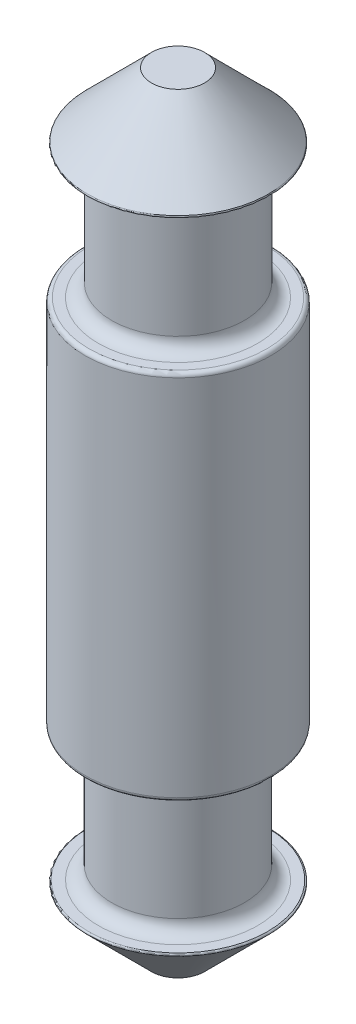
ISO-10303-21;
HEADER;
FILE_DESCRIPTION(('STEP AP214'),'2;1');
FILE_NAME('part.step','',(''),(''),'','','');
FILE_SCHEMA(('AUTOMOTIVE_DESIGN { 1 0 10303 214 1 1 1 1 }'));
ENDSEC;
DATA;
#1=APPLICATION_CONTEXT('core data for automotive mechanical design processes');
#2=APPLICATION_PROTOCOL_DEFINITION('international standard','automotive_design',2000,#1);
#3=PRODUCT_CONTEXT('',#1,'mechanical');
#4=PRODUCT('Part','Part','',(#3));
#5=PRODUCT_RELATED_PRODUCT_CATEGORY('part','',(#4));
#6=PRODUCT_DEFINITION_FORMATION('','',#4);
#7=PRODUCT_DEFINITION_CONTEXT('part definition',#1,'design');
#8=PRODUCT_DEFINITION('design','',#6,#7);
#9=PRODUCT_DEFINITION_SHAPE('','',#8);
#10=(LENGTH_UNIT() NAMED_UNIT(*) SI_UNIT(.MILLI.,.METRE.));
#11=(NAMED_UNIT(*) PLANE_ANGLE_UNIT() SI_UNIT($,.RADIAN.));
#12=(NAMED_UNIT(*) SI_UNIT($,.STERADIAN.) SOLID_ANGLE_UNIT());
#13=UNCERTAINTY_MEASURE_WITH_UNIT(LENGTH_MEASURE(1.E-05),#10,'distance_accuracy_value','');
#14=(GEOMETRIC_REPRESENTATION_CONTEXT(3) GLOBAL_UNCERTAINTY_ASSIGNED_CONTEXT((#13)) GLOBAL_UNIT_ASSIGNED_CONTEXT((#10,
#11,#12)) REPRESENTATION_CONTEXT('',''));
#15=CARTESIAN_POINT('',(0.,0.,0.));
#16=DIRECTION('',(0.,0.,1.));
#17=DIRECTION('',(1.,0.,0.));
#18=AXIS2_PLACEMENT_3D('',#15,#16,#17);
#19=CARTESIAN_POINT('',(0.,24.1,0.));
#20=DIRECTION('',(0.,1.,0.));
#21=DIRECTION('',(0.,0.,1.));
#22=AXIS2_PLACEMENT_3D('',#19,#20,#21);
#23=TOROIDAL_SURFACE('',#22,6.75857864376269,0.1);
#24=CARTESIAN_POINT('',(0.,24.,0.));
#25=DIRECTION('',(0.,1.,0.));
#26=DIRECTION('',(0.,0.,1.));
#27=AXIS2_PLACEMENT_3D('',#24,#25,#26);
#28=CIRCLE('',#27,6.75857864376269);
#29=CARTESIAN_POINT('',(0.,24.,6.75857864376269));
#30=VERTEX_POINT('',#29);
#31=EDGE_CURVE('E103',#30,#30,#28,.F.);
#32=ORIENTED_EDGE('',*,*,#31,.F.);
#33=EDGE_LOOP('',(#32));
#34=FACE_BOUND('',#33,.T.);
#35=CARTESIAN_POINT('',(0.,24.1707106781187,0.));
#36=DIRECTION('',(0.,1.,0.));
#37=DIRECTION('',(0.,0.,1.));
#38=AXIS2_PLACEMENT_3D('',#35,#36,#37);
#39=CIRCLE('',#38,6.82928932188135);
#40=CARTESIAN_POINT('',(0.,24.1707106781187,6.82928932188135));
#41=VERTEX_POINT('',#40);
#42=EDGE_CURVE('E99',#41,#41,#39,.T.);
#43=ORIENTED_EDGE('',*,*,#42,.F.);
#44=EDGE_LOOP('',(#43));
#45=FACE_BOUND('',#44,.T.);
#46=ADVANCED_FACE('F43',(#34,#45),#23,.T.);
#47=CARTESIAN_POINT('',(0.,14.,0.));
#48=DIRECTION('',(0.,-1.,0.));
#49=DIRECTION('',(0.,0.,-1.));
#50=AXIS2_PLACEMENT_3D('',#47,#48,#49);
#51=CYLINDRICAL_SURFACE('',#50,7.);
#52=CARTESIAN_POINT('',(0.,-13.7,0.));
#53=DIRECTION('',(0.,-1.,0.));
#54=DIRECTION('',(0.,0.,-1.));
#55=AXIS2_PLACEMENT_3D('',#52,#53,#54);
#56=CIRCLE('',#55,7.);
#57=CARTESIAN_POINT('',(0.,-13.7,-7.));
#58=VERTEX_POINT('',#57);
#59=EDGE_CURVE('E91',#58,#58,#56,.F.);
#60=ORIENTED_EDGE('',*,*,#59,.T.);
#61=EDGE_LOOP('',(#60));
#62=FACE_BOUND('',#61,.T.);
#63=CARTESIAN_POINT('',(0.,13.7,0.));
#64=DIRECTION('',(0.,1.,0.));
#65=DIRECTION('',(0.,0.,1.));
#66=AXIS2_PLACEMENT_3D('',#63,#64,#65);
#67=CIRCLE('',#66,7.);
#68=CARTESIAN_POINT('',(0.,13.7,7.));
#69=VERTEX_POINT('',#68);
#70=EDGE_CURVE('E95',#69,#69,#67,.F.);
#71=ORIENTED_EDGE('',*,*,#70,.T.);
#72=EDGE_LOOP('',(#71));
#73=FACE_BOUND('',#72,.T.);
#74=ADVANCED_FACE('F141',(#62,#73),#51,.T.);
#75=CARTESIAN_POINT('',(0.,14.,0.));
#76=DIRECTION('',(0.,1.,0.));
#77=DIRECTION('',(0.,0.,1.));
#78=AXIS2_PLACEMENT_3D('',#75,#76,#77);
#79=PLANE('',#78);
#80=CARTESIAN_POINT('',(0.,14.,0.));
#81=DIRECTION('',(0.,1.,0.));
#82=DIRECTION('',(0.,0.,1.));
#83=AXIS2_PLACEMENT_3D('',#80,#81,#82);
#84=CIRCLE('',#83,6.);
#85=CARTESIAN_POINT('',(0.,14.,6.));
#86=VERTEX_POINT('',#85);
#87=EDGE_CURVE('E56',#86,#86,#84,.F.);
#88=ORIENTED_EDGE('',*,*,#87,.T.);
#89=EDGE_LOOP('',(#88));
#90=FACE_BOUND('',#89,.T.);
#91=CARTESIAN_POINT('',(0.,14.,0.));
#92=DIRECTION('',(0.,1.,0.));
#93=DIRECTION('',(0.,0.,1.));
#94=AXIS2_PLACEMENT_3D('',#91,#92,#93);
#95=CIRCLE('',#94,6.7);
#96=CARTESIAN_POINT('',(0.,14.,6.7));
#97=VERTEX_POINT('',#96);
#98=EDGE_CURVE('E83',#97,#97,#95,.T.);
#99=ORIENTED_EDGE('',*,*,#98,.T.);
#100=EDGE_LOOP('',(#99));
#101=FACE_BOUND('',#100,.T.);
#102=ADVANCED_FACE('F147',(#90,#101),#79,.T.);
#103=CARTESIAN_POINT('',(0.,24.,0.));
#104=DIRECTION('',(0.,-1.,0.));
#105=DIRECTION('',(0.,0.,-1.));
#106=AXIS2_PLACEMENT_3D('',#103,#104,#105);
#107=CYLINDRICAL_SURFACE('',#106,5.);
#108=CARTESIAN_POINT('',(0.,15.,0.));
#109=DIRECTION('',(0.,1.,0.));
#110=DIRECTION('',(0.,0.,1.));
#111=AXIS2_PLACEMENT_3D('',#108,#109,#110);
#112=CIRCLE('',#111,5.);
#113=CARTESIAN_POINT('',(0.,15.,5.));
#114=VERTEX_POINT('',#113);
#115=EDGE_CURVE('E61',#114,#114,#112,.T.);
#116=ORIENTED_EDGE('',*,*,#115,.T.);
#117=EDGE_LOOP('',(#116));
#118=FACE_BOUND('',#117,.T.);
#119=CARTESIAN_POINT('',(0.,23.,0.));
#120=DIRECTION('',(0.,1.,0.));
#121=DIRECTION('',(0.,0.,1.));
#122=AXIS2_PLACEMENT_3D('',#119,#120,#121);
#123=CIRCLE('',#122,5.);
#124=CARTESIAN_POINT('',(0.,23.,5.));
#125=VERTEX_POINT('',#124);
#126=EDGE_CURVE('E67',#125,#125,#123,.F.);
#127=ORIENTED_EDGE('',*,*,#126,.T.);
#128=EDGE_LOOP('',(#127));
#129=FACE_BOUND('',#128,.T.);
#130=ADVANCED_FACE('F179',(#118,#129),#107,.T.);
#131=CARTESIAN_POINT('',(0.,24.,0.));
#132=DIRECTION('',(0.,-1.,0.));
#133=DIRECTION('',(0.,0.,1.));
#134=AXIS2_PLACEMENT_3D('',#131,#132,#133);
#135=CONICAL_SURFACE('',#134,7.,0.78539816339745);
#136=ORIENTED_EDGE('',*,*,#42,.T.);
#137=EDGE_LOOP('',(#136));
#138=FACE_BOUND('',#137,.T.);
#139=CARTESIAN_POINT('',(0.,29.,0.));
#140=DIRECTION('',(0.,1.,0.));
#141=DIRECTION('',(0.,0.,1.));
#142=AXIS2_PLACEMENT_3D('',#139,#140,#141);
#143=CIRCLE('',#142,1.99999999999998);
#144=CARTESIAN_POINT('',(0.,29.,1.99999999999998));
#145=VERTEX_POINT('',#144);
#146=EDGE_CURVE('E107',#145,#145,#143,.T.);
#147=ORIENTED_EDGE('',*,*,#146,.F.);
#148=EDGE_LOOP('',(#147));
#149=FACE_BOUND('',#148,.T.);
#150=ADVANCED_FACE('F182',(#138,#149),#135,.T.);
#151=CARTESIAN_POINT('',(0.,29.,0.));
#152=DIRECTION('',(0.,1.,0.));
#153=DIRECTION('',(0.,0.,1.));
#154=AXIS2_PLACEMENT_3D('',#151,#152,#153);
#155=PLANE('',#154);
#156=ORIENTED_EDGE('',*,*,#146,.T.);
#157=EDGE_LOOP('',(#156));
#158=FACE_BOUND('',#157,.T.);
#159=ADVANCED_FACE('F192',(#158),#155,.T.);
#160=CARTESIAN_POINT('',(0.,24.,0.));
#161=DIRECTION('',(0.,1.,0.));
#162=DIRECTION('',(0.,0.,1.));
#163=AXIS2_PLACEMENT_3D('',#160,#161,#162);
#164=PLANE('',#163);
#165=CARTESIAN_POINT('',(0.,24.,0.));
#166=DIRECTION('',(0.,1.,0.));
#167=DIRECTION('',(0.,0.,1.));
#168=AXIS2_PLACEMENT_3D('',#165,#166,#167);
#169=CIRCLE('',#168,6.);
#170=CARTESIAN_POINT('',(0.,24.,6.));
#171=VERTEX_POINT('',#170);
#172=EDGE_CURVE('E71',#171,#171,#169,.T.);
#173=ORIENTED_EDGE('',*,*,#172,.T.);
#174=EDGE_LOOP('',(#173));
#175=FACE_BOUND('',#174,.T.);
#176=ORIENTED_EDGE('',*,*,#31,.T.);
#177=EDGE_LOOP('',(#176));
#178=FACE_BOUND('',#177,.T.);
#179=ADVANCED_FACE('F188',(#175,#178),#164,.F.);
#180=CARTESIAN_POINT('',(0.,-24.1,0.));
#181=DIRECTION('',(0.,-1.,0.));
#182=DIRECTION('',(0.,0.,1.));
#183=AXIS2_PLACEMENT_3D('',#180,#181,#182);
#184=TOROIDAL_SURFACE('',#183,6.75857864376269,0.1);
#185=CARTESIAN_POINT('',(0.,-24.,0.));
#186=DIRECTION('',(0.,1.,0.));
#187=DIRECTION('',(0.,0.,1.));
#188=AXIS2_PLACEMENT_3D('',#185,#186,#187);
#189=CIRCLE('',#188,6.75857864376269);
#190=CARTESIAN_POINT('',(0.,-24.,6.75857864376269));
#191=VERTEX_POINT('',#190);
#192=EDGE_CURVE('E115',#191,#191,#189,.F.);
#193=ORIENTED_EDGE('',*,*,#192,.T.);
#194=EDGE_LOOP('',(#193));
#195=FACE_BOUND('',#194,.T.);
#196=CARTESIAN_POINT('',(0.,-24.1707106781187,0.));
#197=DIRECTION('',(0.,1.,0.));
#198=DIRECTION('',(0.,0.,1.));
#199=AXIS2_PLACEMENT_3D('',#196,#197,#198);
#200=CIRCLE('',#199,6.82928932188135);
#201=CARTESIAN_POINT('',(0.,-24.1707106781187,6.82928932188135));
#202=VERTEX_POINT('',#201);
#203=EDGE_CURVE('E111',#202,#202,#200,.T.);
#204=ORIENTED_EDGE('',*,*,#203,.T.);
#205=EDGE_LOOP('',(#204));
#206=FACE_BOUND('',#205,.T.);
#207=ADVANCED_FACE('F191',(#195,#206),#184,.T.);
#208=CARTESIAN_POINT('',(0.,-14.,0.));
#209=DIRECTION('',(0.,-1.,0.));
#210=DIRECTION('',(0.,0.,1.));
#211=AXIS2_PLACEMENT_3D('',#208,#209,#210);
#212=PLANE('',#211);
#213=CARTESIAN_POINT('',(0.,-14.,0.));
#214=DIRECTION('',(0.,-1.,0.));
#215=DIRECTION('',(0.,0.,-1.));
#216=AXIS2_PLACEMENT_3D('',#213,#214,#215);
#217=CIRCLE('',#216,6.);
#218=CARTESIAN_POINT('',(0.,-14.,-6.));
#219=VERTEX_POINT('',#218);
#220=EDGE_CURVE('E51',#219,#219,#217,.F.);
#221=ORIENTED_EDGE('',*,*,#220,.T.);
#222=EDGE_LOOP('',(#221));
#223=FACE_BOUND('',#222,.T.);
#224=CARTESIAN_POINT('',(0.,-14.,0.));
#225=DIRECTION('',(0.,-1.,0.));
#226=DIRECTION('',(0.,0.,-1.));
#227=AXIS2_PLACEMENT_3D('',#224,#225,#226);
#228=CIRCLE('',#227,6.7);
#229=CARTESIAN_POINT('',(0.,-14.,-6.7));
#230=VERTEX_POINT('',#229);
#231=EDGE_CURVE('E87',#230,#230,#228,.T.);
#232=ORIENTED_EDGE('',*,*,#231,.T.);
#233=EDGE_LOOP('',(#232));
#234=FACE_BOUND('',#233,.T.);
#235=ADVANCED_FACE('F198',(#223,#234),#212,.T.);
#236=CARTESIAN_POINT('',(0.,-24.,0.));
#237=DIRECTION('',(0.,1.,0.));
#238=DIRECTION('',(0.,0.,-1.));
#239=AXIS2_PLACEMENT_3D('',#236,#237,#238);
#240=CYLINDRICAL_SURFACE('',#239,5.);
#241=CARTESIAN_POINT('',(0.,-15.,0.));
#242=DIRECTION('',(0.,-1.,0.));
#243=DIRECTION('',(0.,0.,-1.));
#244=AXIS2_PLACEMENT_3D('',#241,#242,#243);
#245=CIRCLE('',#244,5.);
#246=CARTESIAN_POINT('',(0.,-15.,-5.));
#247=VERTEX_POINT('',#246);
#248=EDGE_CURVE('E10',#247,#247,#245,.T.);
#249=ORIENTED_EDGE('',*,*,#248,.T.);
#250=EDGE_LOOP('',(#249));
#251=FACE_BOUND('',#250,.T.);
#252=CARTESIAN_POINT('',(0.,-23.,0.));
#253=DIRECTION('',(0.,-1.,0.));
#254=DIRECTION('',(0.,0.,-1.));
#255=AXIS2_PLACEMENT_3D('',#252,#253,#254);
#256=CIRCLE('',#255,5.);
#257=CARTESIAN_POINT('',(0.,-23.,-5.));
#258=VERTEX_POINT('',#257);
#259=EDGE_CURVE('E79',#258,#258,#256,.F.);
#260=ORIENTED_EDGE('',*,*,#259,.T.);
#261=EDGE_LOOP('',(#260));
#262=FACE_BOUND('',#261,.T.);
#263=ADVANCED_FACE('F137',(#251,#262),#240,.T.);
#264=CARTESIAN_POINT('',(0.,-24.,0.));
#265=DIRECTION('',(0.,1.,0.));
#266=DIRECTION('',(0.,0.,1.));
#267=AXIS2_PLACEMENT_3D('',#264,#265,#266);
#268=CONICAL_SURFACE('',#267,7.,0.78539816339745);
#269=ORIENTED_EDGE('',*,*,#203,.F.);
#270=EDGE_LOOP('',(#269));
#271=FACE_BOUND('',#270,.T.);
#272=CARTESIAN_POINT('',(0.,-29.,0.));
#273=DIRECTION('',(0.,1.,0.));
#274=DIRECTION('',(0.,0.,1.));
#275=AXIS2_PLACEMENT_3D('',#272,#273,#274);
#276=CIRCLE('',#275,1.99999999999998);
#277=CARTESIAN_POINT('',(0.,-29.,1.99999999999998));
#278=VERTEX_POINT('',#277);
#279=EDGE_CURVE('E119',#278,#278,#276,.T.);
#280=ORIENTED_EDGE('',*,*,#279,.T.);
#281=EDGE_LOOP('',(#280));
#282=FACE_BOUND('',#281,.T.);
#283=ADVANCED_FACE('F124',(#271,#282),#268,.T.);
#284=CARTESIAN_POINT('',(0.,-29.,0.));
#285=DIRECTION('',(0.,-1.,0.));
#286=DIRECTION('',(0.,0.,1.));
#287=AXIS2_PLACEMENT_3D('',#284,#285,#286);
#288=PLANE('',#287);
#289=ORIENTED_EDGE('',*,*,#279,.F.);
#290=EDGE_LOOP('',(#289));
#291=FACE_BOUND('',#290,.T.);
#292=ADVANCED_FACE('F126',(#291),#288,.T.);
#293=CARTESIAN_POINT('',(0.,-24.,0.));
#294=DIRECTION('',(0.,-1.,0.));
#295=DIRECTION('',(0.,0.,1.));
#296=AXIS2_PLACEMENT_3D('',#293,#294,#295);
#297=PLANE('',#296);
#298=CARTESIAN_POINT('',(0.,-24.,0.));
#299=DIRECTION('',(0.,-1.,0.));
#300=DIRECTION('',(0.,0.,-1.));
#301=AXIS2_PLACEMENT_3D('',#298,#299,#300);
#302=CIRCLE('',#301,6.);
#303=CARTESIAN_POINT('',(0.,-24.,-6.));
#304=VERTEX_POINT('',#303);
#305=EDGE_CURVE('E75',#304,#304,#302,.T.);
#306=ORIENTED_EDGE('',*,*,#305,.T.);
#307=EDGE_LOOP('',(#306));
#308=FACE_BOUND('',#307,.T.);
#309=ORIENTED_EDGE('',*,*,#192,.F.);
#310=EDGE_LOOP('',(#309));
#311=FACE_BOUND('',#310,.T.);
#312=ADVANCED_FACE('F128',(#308,#311),#297,.F.);
#313=CARTESIAN_POINT('',(0.,-13.7,0.));
#314=DIRECTION('',(0.,-1.,0.));
#315=DIRECTION('',(0.,0.,-1.));
#316=AXIS2_PLACEMENT_3D('',#313,#314,#315);
#317=TOROIDAL_SURFACE('',#316,6.7,0.3);
#318=ORIENTED_EDGE('',*,*,#231,.F.);
#319=EDGE_LOOP('',(#318));
#320=FACE_BOUND('',#319,.T.);
#321=ORIENTED_EDGE('',*,*,#59,.F.);
#322=EDGE_LOOP('',(#321));
#323=FACE_BOUND('',#322,.T.);
#324=ADVANCED_FACE('F134',(#320,#323),#317,.T.);
#325=CARTESIAN_POINT('',(0.,13.7,0.));
#326=DIRECTION('',(0.,1.,0.));
#327=DIRECTION('',(0.,0.,1.));
#328=AXIS2_PLACEMENT_3D('',#325,#326,#327);
#329=TOROIDAL_SURFACE('',#328,6.7,0.3);
#330=ORIENTED_EDGE('',*,*,#70,.F.);
#331=EDGE_LOOP('',(#330));
#332=FACE_BOUND('',#331,.T.);
#333=ORIENTED_EDGE('',*,*,#98,.F.);
#334=EDGE_LOOP('',(#333));
#335=FACE_BOUND('',#334,.T.);
#336=ADVANCED_FACE('F156',(#332,#335),#329,.T.);
#337=CARTESIAN_POINT('',(0.,-23.,0.));
#338=DIRECTION('',(0.,-1.,0.));
#339=DIRECTION('',(0.,0.,-1.));
#340=AXIS2_PLACEMENT_3D('',#337,#338,#339);
#341=TOROIDAL_SURFACE('',#340,6.,1.);
#342=ORIENTED_EDGE('',*,*,#305,.F.);
#343=EDGE_LOOP('',(#342));
#344=FACE_BOUND('',#343,.T.);
#345=ORIENTED_EDGE('',*,*,#259,.F.);
#346=EDGE_LOOP('',(#345));
#347=FACE_BOUND('',#346,.T.);
#348=ADVANCED_FACE('F160',(#344,#347),#341,.F.);
#349=CARTESIAN_POINT('',(0.,23.,0.));
#350=DIRECTION('',(0.,1.,0.));
#351=DIRECTION('',(0.,0.,1.));
#352=AXIS2_PLACEMENT_3D('',#349,#350,#351);
#353=TOROIDAL_SURFACE('',#352,6.,1.);
#354=ORIENTED_EDGE('',*,*,#126,.F.);
#355=EDGE_LOOP('',(#354));
#356=FACE_BOUND('',#355,.T.);
#357=ORIENTED_EDGE('',*,*,#172,.F.);
#358=EDGE_LOOP('',(#357));
#359=FACE_BOUND('',#358,.T.);
#360=ADVANCED_FACE('F164',(#356,#359),#353,.F.);
#361=CARTESIAN_POINT('',(0.,15.,0.));
#362=DIRECTION('',(0.,1.,0.));
#363=DIRECTION('',(0.,0.,1.));
#364=AXIS2_PLACEMENT_3D('',#361,#362,#363);
#365=TOROIDAL_SURFACE('',#364,6.,1.);
#366=ORIENTED_EDGE('',*,*,#87,.F.);
#367=EDGE_LOOP('',(#366));
#368=FACE_BOUND('',#367,.T.);
#369=ORIENTED_EDGE('',*,*,#115,.F.);
#370=EDGE_LOOP('',(#369));
#371=FACE_BOUND('',#370,.T.);
#372=ADVANCED_FACE('F167',(#368,#371),#365,.F.);
#373=CARTESIAN_POINT('',(0.,-15.,0.));
#374=DIRECTION('',(0.,-1.,0.));
#375=DIRECTION('',(0.,0.,-1.));
#376=AXIS2_PLACEMENT_3D('',#373,#374,#375);
#377=TOROIDAL_SURFACE('',#376,6.,1.);
#378=ORIENTED_EDGE('',*,*,#248,.F.);
#379=EDGE_LOOP('',(#378));
#380=FACE_BOUND('',#379,.T.);
#381=ORIENTED_EDGE('',*,*,#220,.F.);
#382=EDGE_LOOP('',(#381));
#383=FACE_BOUND('',#382,.T.);
#384=ADVANCED_FACE('F45',(#380,#383),#377,.F.);
#385=CLOSED_SHELL('',(#46,#74,#102,#130,#150,#159,#179,#207,#235,#263,#283,#292,#312,#324,#336,
#348,#360,#372,#384));
#386=MANIFOLD_SOLID_BREP('B2',#385);
#387=ADVANCED_BREP_SHAPE_REPRESENTATION('',(#18,#386),#14);
#388=SHAPE_DEFINITION_REPRESENTATION(#9,#387);
ENDSEC;
END-ISO-10303-21;
